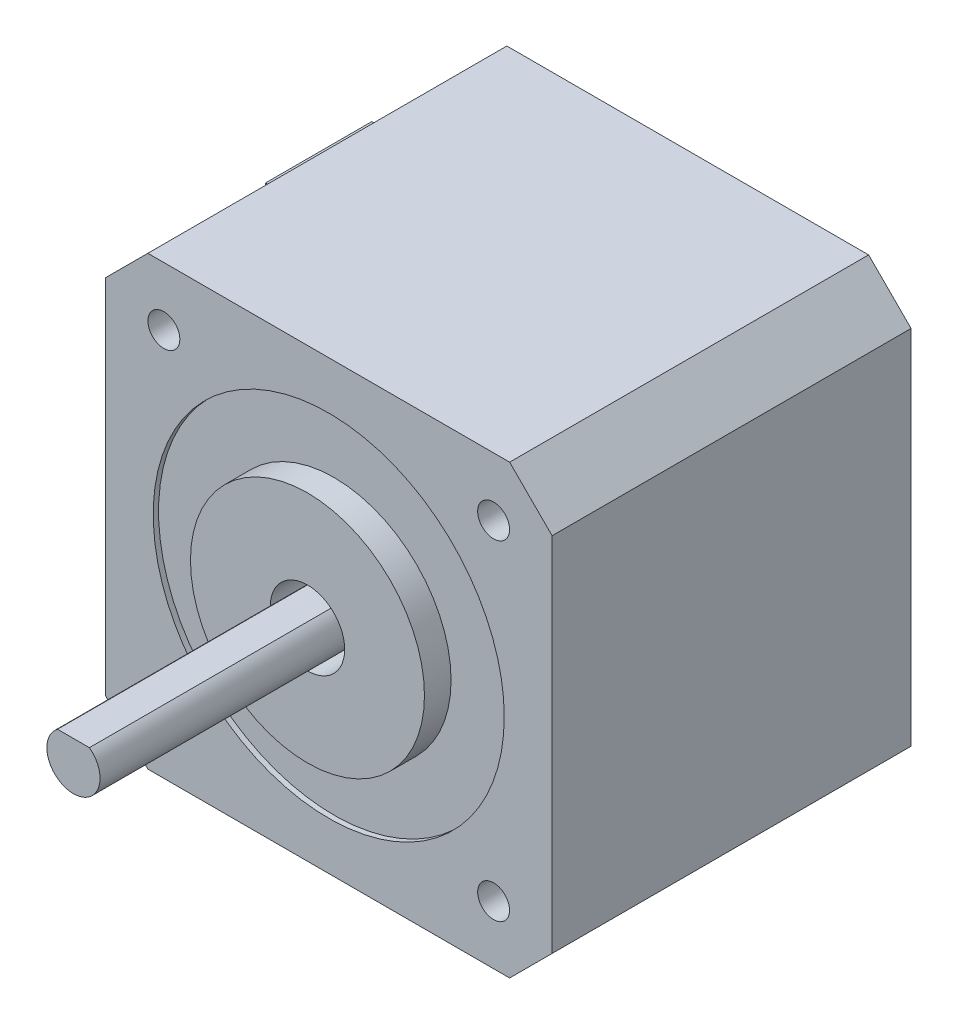
ISO-10303-21;
HEADER;
FILE_DESCRIPTION(('STEP AP214'),'2;1');
FILE_NAME('part.step','',(''),(''),'','','');
FILE_SCHEMA(('AUTOMOTIVE_DESIGN { 1 0 10303 214 1 1 1 1 }'));
ENDSEC;
DATA;
#1=APPLICATION_CONTEXT('core data for automotive mechanical design processes');
#2=APPLICATION_PROTOCOL_DEFINITION('international standard','automotive_design',2000,#1);
#3=PRODUCT_CONTEXT('',#1,'mechanical');
#4=PRODUCT('Part','Part','',(#3));
#5=PRODUCT_RELATED_PRODUCT_CATEGORY('part','',(#4));
#6=PRODUCT_DEFINITION_FORMATION('','',#4);
#7=PRODUCT_DEFINITION_CONTEXT('part definition',#1,'design');
#8=PRODUCT_DEFINITION('design','',#6,#7);
#9=PRODUCT_DEFINITION_SHAPE('','',#8);
#10=(LENGTH_UNIT() NAMED_UNIT(*) SI_UNIT(.MILLI.,.METRE.));
#11=(NAMED_UNIT(*) PLANE_ANGLE_UNIT() SI_UNIT($,.RADIAN.));
#12=(NAMED_UNIT(*) SI_UNIT($,.STERADIAN.) SOLID_ANGLE_UNIT());
#13=UNCERTAINTY_MEASURE_WITH_UNIT(LENGTH_MEASURE(1.E-05),#10,'distance_accuracy_value','');
#14=(GEOMETRIC_REPRESENTATION_CONTEXT(3) GLOBAL_UNCERTAINTY_ASSIGNED_CONTEXT((#13)) GLOBAL_UNIT_ASSIGNED_CONTEXT((#10,
#11,#12)) REPRESENTATION_CONTEXT('',''));
#15=CARTESIAN_POINT('',(0.,0.,0.));
#16=DIRECTION('',(0.,0.,1.));
#17=DIRECTION('',(1.,0.,0.));
#18=AXIS2_PLACEMENT_3D('',#15,#16,#17);
#19=CARTESIAN_POINT('',(-21.,17.0069894887769,33.75));
#20=DIRECTION('',(1.,0.,0.));
#21=DIRECTION('',(0.,0.,-1.));
#22=AXIS2_PLACEMENT_3D('',#19,#20,#21);
#23=PLANE('',#22);
#24=DIRECTION('',(0.,0.,-1.));
#25=VECTOR('',#24,1.);
#26=CARTESIAN_POINT('',(-21.,8.5,0.));
#27=LINE('',#26,#25);
#28=CARTESIAN_POINT('',(-21.,8.5,10.));
#29=VERTEX_POINT('',#28);
#30=CARTESIAN_POINT('',(-21.,8.5,0.));
#31=VERTEX_POINT('',#30);
#32=EDGE_CURVE('E50',#29,#31,#27,.T.);
#33=ORIENTED_EDGE('',*,*,#32,.F.);
#34=DIRECTION('',(0.,1.,0.));
#35=VECTOR('',#34,1.);
#36=CARTESIAN_POINT('',(-21.,8.5,10.));
#37=LINE('',#36,#35);
#38=CARTESIAN_POINT('',(-21.,-8.5,10.));
#39=VERTEX_POINT('',#38);
#40=EDGE_CURVE('E174',#39,#29,#37,.T.);
#41=ORIENTED_EDGE('',*,*,#40,.F.);
#42=DIRECTION('',(0.,0.,1.));
#43=VECTOR('',#42,1.);
#44=CARTESIAN_POINT('',(-21.,-8.5,0.));
#45=LINE('',#44,#43);
#46=CARTESIAN_POINT('',(-21.,-8.5,0.));
#47=VERTEX_POINT('',#46);
#48=EDGE_CURVE('E56',#47,#39,#45,.T.);
#49=ORIENTED_EDGE('',*,*,#48,.F.);
#50=DIRECTION('',(0.,-1.,0.));
#51=VECTOR('',#50,1.);
#52=CARTESIAN_POINT('',(-21.,17.0069894887769,0.));
#53=LINE('',#52,#51);
#54=CARTESIAN_POINT('',(-21.,-17.0069894887769,0.));
#55=VERTEX_POINT('',#54);
#56=EDGE_CURVE('E159',#47,#55,#53,.T.);
#57=ORIENTED_EDGE('',*,*,#56,.T.);
#58=DIRECTION('',(0.,0.,-1.));
#59=VECTOR('',#58,1.);
#60=CARTESIAN_POINT('',(-21.,-17.0069894887769,33.75));
#61=LINE('',#60,#59);
#62=CARTESIAN_POINT('',(-21.,-17.0069894887769,33.75));
#63=VERTEX_POINT('',#62);
#64=EDGE_CURVE('E11',#63,#55,#61,.T.);
#65=ORIENTED_EDGE('',*,*,#64,.F.);
#66=DIRECTION('',(0.,-1.,0.));
#67=VECTOR('',#66,1.);
#68=CARTESIAN_POINT('',(-21.,17.0069894887769,33.75));
#69=LINE('',#68,#67);
#70=CARTESIAN_POINT('',(-21.,17.0069894887769,33.75));
#71=VERTEX_POINT('',#70);
#72=EDGE_CURVE('E259',#71,#63,#69,.T.);
#73=ORIENTED_EDGE('',*,*,#72,.F.);
#74=DIRECTION('',(0.,0.,-1.));
#75=VECTOR('',#74,1.);
#76=CARTESIAN_POINT('',(-21.,17.0069894887769,33.75));
#77=LINE('',#76,#75);
#78=CARTESIAN_POINT('',(-21.,17.0069894887769,0.));
#79=VERTEX_POINT('',#78);
#80=EDGE_CURVE('E277',#71,#79,#77,.T.);
#81=ORIENTED_EDGE('',*,*,#80,.T.);
#82=EDGE_CURVE('E285',#79,#31,#53,.T.);
#83=ORIENTED_EDGE('',*,*,#82,.T.);
#84=EDGE_LOOP('',(#33,#41,#49,#57,#65,#73,#81,#83));
#85=FACE_BOUND('',#84,.T.);
#86=ADVANCED_FACE('F34',(#85),#23,.F.);
#87=CARTESIAN_POINT('',(0.,0.,0.));
#88=DIRECTION('',(0.,0.,1.));
#89=DIRECTION('',(1.,0.,0.));
#90=AXIS2_PLACEMENT_3D('',#87,#88,#89);
#91=PLANE('',#90);
#92=CARTESIAN_POINT('',(-15.5,15.5,0.));
#93=DIRECTION('',(0.,0.,1.));
#94=DIRECTION('',(1.,0.,0.));
#95=AXIS2_PLACEMENT_3D('',#92,#93,#94);
#96=CIRCLE('',#95,1.5);
#97=CARTESIAN_POINT('',(-14.,15.5,0.));
#98=VERTEX_POINT('',#97);
#99=EDGE_CURVE('E183',#98,#98,#96,.T.);
#100=ORIENTED_EDGE('',*,*,#99,.T.);
#101=EDGE_LOOP('',(#100));
#102=FACE_BOUND('',#101,.T.);
#103=CARTESIAN_POINT('',(-15.5,-15.5,0.));
#104=DIRECTION('',(0.,0.,1.));
#105=DIRECTION('',(1.,0.,0.));
#106=AXIS2_PLACEMENT_3D('',#103,#104,#105);
#107=CIRCLE('',#106,1.5);
#108=CARTESIAN_POINT('',(-14.,-15.5,0.));
#109=VERTEX_POINT('',#108);
#110=EDGE_CURVE('E194',#109,#109,#107,.T.);
#111=ORIENTED_EDGE('',*,*,#110,.T.);
#112=EDGE_LOOP('',(#111));
#113=FACE_BOUND('',#112,.T.);
#114=ORIENTED_EDGE('',*,*,#82,.F.);
#115=DIRECTION('',(-0.707106781186548,-0.707106781186548,0.));
#116=VECTOR('',#115,1.);
#117=CARTESIAN_POINT('',(-17.0069894887769,21.,0.));
#118=LINE('',#117,#116);
#119=CARTESIAN_POINT('',(-17.0069894887769,21.,0.));
#120=VERTEX_POINT('',#119);
#121=EDGE_CURVE('E263',#120,#79,#118,.T.);
#122=ORIENTED_EDGE('',*,*,#121,.F.);
#123=DIRECTION('',(-1.,0.,0.));
#124=VECTOR('',#123,1.);
#125=CARTESIAN_POINT('',(-17.0069894887769,21.,0.));
#126=LINE('',#125,#124);
#127=CARTESIAN_POINT('',(17.0069894887769,21.,0.));
#128=VERTEX_POINT('',#127);
#129=EDGE_CURVE('E307',#128,#120,#126,.T.);
#130=ORIENTED_EDGE('',*,*,#129,.F.);
#131=DIRECTION('',(-0.707106781186549,0.707106781186546,0.));
#132=VECTOR('',#131,1.);
#133=CARTESIAN_POINT('',(17.0069894887769,21.,0.));
#134=LINE('',#133,#132);
#135=CARTESIAN_POINT('',(21.,17.0069894887769,0.));
#136=VERTEX_POINT('',#135);
#137=EDGE_CURVE('E309',#136,#128,#134,.T.);
#138=ORIENTED_EDGE('',*,*,#137,.F.);
#139=DIRECTION('',(0.,1.,0.));
#140=VECTOR('',#139,1.);
#141=CARTESIAN_POINT('',(21.,17.0069894887769,0.));
#142=LINE('',#141,#140);
#143=CARTESIAN_POINT('',(21.,-17.0069894887769,0.));
#144=VERTEX_POINT('',#143);
#145=EDGE_CURVE('E311',#144,#136,#142,.T.);
#146=ORIENTED_EDGE('',*,*,#145,.F.);
#147=DIRECTION('',(0.707106781186548,0.707106781186547,0.));
#148=VECTOR('',#147,1.);
#149=CARTESIAN_POINT('',(21.,-17.0069894887769,0.));
#150=LINE('',#149,#148);
#151=CARTESIAN_POINT('',(17.0069894887769,-21.,0.));
#152=VERTEX_POINT('',#151);
#153=EDGE_CURVE('E313',#152,#144,#150,.T.);
#154=ORIENTED_EDGE('',*,*,#153,.F.);
#155=DIRECTION('',(1.,0.,0.));
#156=VECTOR('',#155,1.);
#157=CARTESIAN_POINT('',(-17.0069894887769,-21.,0.));
#158=LINE('',#157,#156);
#159=CARTESIAN_POINT('',(-17.0069894887769,-21.,0.));
#160=VERTEX_POINT('',#159);
#161=EDGE_CURVE('E314',#160,#152,#158,.T.);
#162=ORIENTED_EDGE('',*,*,#161,.F.);
#163=DIRECTION('',(0.707106781186548,-0.707106781186547,0.));
#164=VECTOR('',#163,1.);
#165=CARTESIAN_POINT('',(-21.,-17.0069894887769,0.));
#166=LINE('',#165,#164);
#167=EDGE_CURVE('E280',#55,#160,#166,.T.);
#168=ORIENTED_EDGE('',*,*,#167,.F.);
#169=ORIENTED_EDGE('',*,*,#56,.F.);
#170=DIRECTION('',(1.,0.,0.));
#171=VECTOR('',#170,1.);
#172=CARTESIAN_POINT('',(-29.7,-8.5,0.));
#173=LINE('',#172,#171);
#174=CARTESIAN_POINT('',(-29.7,-8.5,0.));
#175=VERTEX_POINT('',#174);
#176=EDGE_CURVE('E139',#175,#47,#173,.T.);
#177=ORIENTED_EDGE('',*,*,#176,.F.);
#178=DIRECTION('',(0.,-1.,0.));
#179=VECTOR('',#178,1.);
#180=CARTESIAN_POINT('',(-29.7,8.49999999999999,0.));
#181=LINE('',#180,#179);
#182=CARTESIAN_POINT('',(-29.7,8.49999999999999,0.));
#183=VERTEX_POINT('',#182);
#184=EDGE_CURVE('E145',#183,#175,#181,.T.);
#185=ORIENTED_EDGE('',*,*,#184,.F.);
#186=DIRECTION('',(1.,0.,0.));
#187=VECTOR('',#186,1.);
#188=CARTESIAN_POINT('',(-29.7,8.49999999999999,0.));
#189=LINE('',#188,#187);
#190=EDGE_CURVE('E175',#183,#31,#189,.T.);
#191=ORIENTED_EDGE('',*,*,#190,.T.);
#192=EDGE_LOOP('',(#114,#122,#130,#138,#146,#154,#162,#168,#169,#177,#185,#191));
#193=FACE_BOUND('',#192,.T.);
#194=CARTESIAN_POINT('',(15.5,-15.5,0.));
#195=DIRECTION('',(0.,0.,1.));
#196=DIRECTION('',(1.,0.,0.));
#197=AXIS2_PLACEMENT_3D('',#194,#195,#196);
#198=CIRCLE('',#197,1.5);
#199=CARTESIAN_POINT('',(17.,-15.5,0.));
#200=VERTEX_POINT('',#199);
#201=EDGE_CURVE('E188',#200,#200,#198,.T.);
#202=ORIENTED_EDGE('',*,*,#201,.T.);
#203=EDGE_LOOP('',(#202));
#204=FACE_BOUND('',#203,.T.);
#205=CARTESIAN_POINT('',(15.5,15.5,0.));
#206=DIRECTION('',(0.,0.,1.));
#207=DIRECTION('',(1.,0.,0.));
#208=AXIS2_PLACEMENT_3D('',#205,#206,#207);
#209=CIRCLE('',#208,1.5);
#210=CARTESIAN_POINT('',(17.,15.5,0.));
#211=VERTEX_POINT('',#210);
#212=EDGE_CURVE('E160',#211,#211,#209,.T.);
#213=ORIENTED_EDGE('',*,*,#212,.T.);
#214=EDGE_LOOP('',(#213));
#215=FACE_BOUND('',#214,.T.);
#216=ADVANCED_FACE('F156',(#102,#113,#193,#204,#215),#91,.F.);
#217=CARTESIAN_POINT('',(0.,0.,30.75));
#218=DIRECTION('',(0.,0.,1.));
#219=DIRECTION('',(1.,0.,0.));
#220=AXIS2_PLACEMENT_3D('',#217,#218,#219);
#221=PLANE('',#220);
#222=CARTESIAN_POINT('',(0.,0.,30.75));
#223=DIRECTION('',(0.,0.,1.));
#224=DIRECTION('',(1.,0.,0.));
#225=AXIS2_PLACEMENT_3D('',#222,#223,#224);
#226=CIRCLE('',#225,3.5);
#227=CARTESIAN_POINT('',(3.5,0.,30.75));
#228=VERTEX_POINT('',#227);
#229=EDGE_CURVE('E242',#228,#228,#226,.T.);
#230=ORIENTED_EDGE('',*,*,#229,.T.);
#231=EDGE_LOOP('',(#230));
#232=FACE_BOUND('',#231,.T.);
#233=DIRECTION('',(-1.,0.,0.));
#234=VECTOR('',#233,1.);
#235=CARTESIAN_POINT('',(-1.5,2.,30.75));
#236=LINE('',#235,#234);
#237=CARTESIAN_POINT('',(1.49999999999999,2.,30.75));
#238=VERTEX_POINT('',#237);
#239=CARTESIAN_POINT('',(-1.5,2.,30.75));
#240=VERTEX_POINT('',#239);
#241=EDGE_CURVE('E231',#238,#240,#236,.T.);
#242=ORIENTED_EDGE('',*,*,#241,.F.);
#243=CARTESIAN_POINT('',(0.,0.,30.75));
#244=DIRECTION('',(0.,0.,1.));
#245=DIRECTION('',(1.,0.,0.));
#246=AXIS2_PLACEMENT_3D('',#243,#244,#245);
#247=CIRCLE('',#246,2.5);
#248=EDGE_CURVE('E224',#240,#238,#247,.T.);
#249=ORIENTED_EDGE('',*,*,#248,.F.);
#250=EDGE_LOOP('',(#242,#249));
#251=FACE_BOUND('',#250,.T.);
#252=ADVANCED_FACE('F346',(#232,#251),#221,.T.);
#253=CARTESIAN_POINT('',(0.,0.,33.25));
#254=DIRECTION('',(0.,0.,1.));
#255=DIRECTION('',(1.,0.,0.));
#256=AXIS2_PLACEMENT_3D('',#253,#254,#255);
#257=PLANE('',#256);
#258=CARTESIAN_POINT('',(0.,0.,33.25));
#259=DIRECTION('',(0.,0.,1.));
#260=DIRECTION('',(1.,0.,0.));
#261=AXIS2_PLACEMENT_3D('',#258,#259,#260);
#262=CIRCLE('',#261,16.5);
#263=CARTESIAN_POINT('',(16.5,0.,33.25));
#264=VERTEX_POINT('',#263);
#265=EDGE_CURVE('E254',#264,#264,#262,.T.);
#266=ORIENTED_EDGE('',*,*,#265,.T.);
#267=EDGE_LOOP('',(#266));
#268=FACE_BOUND('',#267,.T.);
#269=CARTESIAN_POINT('',(0.,0.,33.25));
#270=DIRECTION('',(0.,0.,1.));
#271=DIRECTION('',(1.,0.,0.));
#272=AXIS2_PLACEMENT_3D('',#269,#270,#271);
#273=CIRCLE('',#272,11.);
#274=CARTESIAN_POINT('',(11.,0.,33.25));
#275=VERTEX_POINT('',#274);
#276=EDGE_CURVE('E245',#275,#275,#273,.T.);
#277=ORIENTED_EDGE('',*,*,#276,.F.);
#278=EDGE_LOOP('',(#277));
#279=FACE_BOUND('',#278,.T.);
#280=ADVANCED_FACE('F352',(#268,#279),#257,.T.);
#281=CARTESIAN_POINT('',(-21.,-17.0069894887769,33.75));
#282=DIRECTION('',(0.707106781186547,0.707106781186548,0.));
#283=DIRECTION('',(-0.707106781186548,0.707106781186547,0.));
#284=AXIS2_PLACEMENT_3D('',#281,#282,#283);
#285=PLANE('',#284);
#286=ORIENTED_EDGE('',*,*,#167,.T.);
#287=DIRECTION('',(0.,0.,-1.));
#288=VECTOR('',#287,1.);
#289=CARTESIAN_POINT('',(-17.0069894887769,-21.,33.75));
#290=LINE('',#289,#288);
#291=CARTESIAN_POINT('',(-17.0069894887769,-21.,33.75));
#292=VERTEX_POINT('',#291);
#293=EDGE_CURVE('E42',#292,#160,#290,.T.);
#294=ORIENTED_EDGE('',*,*,#293,.F.);
#295=DIRECTION('',(0.707106781186548,-0.707106781186547,0.));
#296=VECTOR('',#295,1.);
#297=CARTESIAN_POINT('',(-21.,-17.0069894887769,33.75));
#298=LINE('',#297,#296);
#299=EDGE_CURVE('E262',#63,#292,#298,.T.);
#300=ORIENTED_EDGE('',*,*,#299,.F.);
#301=ORIENTED_EDGE('',*,*,#64,.T.);
#302=EDGE_LOOP('',(#286,#294,#300,#301));
#303=FACE_BOUND('',#302,.T.);
#304=ADVANCED_FACE('F320',(#303),#285,.F.);
#305=CARTESIAN_POINT('',(-17.0069894887769,-21.,33.75));
#306=DIRECTION('',(0.,1.,0.));
#307=DIRECTION('',(-1.,0.,0.));
#308=AXIS2_PLACEMENT_3D('',#305,#306,#307);
#309=PLANE('',#308);
#310=ORIENTED_EDGE('',*,*,#161,.T.);
#311=DIRECTION('',(0.,0.,-1.));
#312=VECTOR('',#311,1.);
#313=CARTESIAN_POINT('',(17.0069894887769,-21.,33.75));
#314=LINE('',#313,#312);
#315=CARTESIAN_POINT('',(17.0069894887769,-21.,33.75));
#316=VERTEX_POINT('',#315);
#317=EDGE_CURVE('E289',#316,#152,#314,.T.);
#318=ORIENTED_EDGE('',*,*,#317,.F.);
#319=DIRECTION('',(1.,0.,0.));
#320=VECTOR('',#319,1.);
#321=CARTESIAN_POINT('',(-17.0069894887769,-21.,33.75));
#322=LINE('',#321,#320);
#323=EDGE_CURVE('E265',#292,#316,#322,.T.);
#324=ORIENTED_EDGE('',*,*,#323,.F.);
#325=ORIENTED_EDGE('',*,*,#293,.T.);
#326=EDGE_LOOP('',(#310,#318,#324,#325));
#327=FACE_BOUND('',#326,.T.);
#328=ADVANCED_FACE('F323',(#327),#309,.F.);
#329=CARTESIAN_POINT('',(21.,-17.0069894887769,33.75));
#330=DIRECTION('',(-0.707106781186547,0.707106781186548,0.));
#331=DIRECTION('',(-0.707106781186548,-0.707106781186547,0.));
#332=AXIS2_PLACEMENT_3D('',#329,#330,#331);
#333=PLANE('',#332);
#334=ORIENTED_EDGE('',*,*,#153,.T.);
#335=DIRECTION('',(0.,0.,-1.));
#336=VECTOR('',#335,1.);
#337=CARTESIAN_POINT('',(21.,-17.0069894887769,33.75));
#338=LINE('',#337,#336);
#339=CARTESIAN_POINT('',(21.,-17.0069894887769,33.75));
#340=VERTEX_POINT('',#339);
#341=EDGE_CURVE('E292',#340,#144,#338,.T.);
#342=ORIENTED_EDGE('',*,*,#341,.F.);
#343=DIRECTION('',(0.707106781186548,0.707106781186547,0.));
#344=VECTOR('',#343,1.);
#345=CARTESIAN_POINT('',(21.,-17.0069894887769,33.75));
#346=LINE('',#345,#344);
#347=EDGE_CURVE('E267',#316,#340,#346,.T.);
#348=ORIENTED_EDGE('',*,*,#347,.F.);
#349=ORIENTED_EDGE('',*,*,#317,.T.);
#350=EDGE_LOOP('',(#334,#342,#348,#349));
#351=FACE_BOUND('',#350,.T.);
#352=ADVANCED_FACE('F329',(#351),#333,.F.);
#353=CARTESIAN_POINT('',(21.,17.0069894887769,33.75));
#354=DIRECTION('',(-1.,0.,0.));
#355=DIRECTION('',(0.,0.,1.));
#356=AXIS2_PLACEMENT_3D('',#353,#354,#355);
#357=PLANE('',#356);
#358=ORIENTED_EDGE('',*,*,#145,.T.);
#359=DIRECTION('',(0.,0.,-1.));
#360=VECTOR('',#359,1.);
#361=CARTESIAN_POINT('',(21.,17.0069894887769,33.75));
#362=LINE('',#361,#360);
#363=CARTESIAN_POINT('',(21.,17.0069894887769,33.75));
#364=VERTEX_POINT('',#363);
#365=EDGE_CURVE('E295',#364,#136,#362,.T.);
#366=ORIENTED_EDGE('',*,*,#365,.F.);
#367=DIRECTION('',(0.,1.,0.));
#368=VECTOR('',#367,1.);
#369=CARTESIAN_POINT('',(21.,17.0069894887769,33.75));
#370=LINE('',#369,#368);
#371=EDGE_CURVE('E269',#340,#364,#370,.T.);
#372=ORIENTED_EDGE('',*,*,#371,.F.);
#373=ORIENTED_EDGE('',*,*,#341,.T.);
#374=EDGE_LOOP('',(#358,#366,#372,#373));
#375=FACE_BOUND('',#374,.T.);
#376=ADVANCED_FACE('F333',(#375),#357,.F.);
#377=CARTESIAN_POINT('',(17.0069894887769,21.,33.75));
#378=DIRECTION('',(-0.707106781186546,-0.707106781186549,0.));
#379=DIRECTION('',(0.707106781186549,-0.707106781186546,0.));
#380=AXIS2_PLACEMENT_3D('',#377,#378,#379);
#381=PLANE('',#380);
#382=ORIENTED_EDGE('',*,*,#137,.T.);
#383=DIRECTION('',(0.,0.,-1.));
#384=VECTOR('',#383,1.);
#385=CARTESIAN_POINT('',(17.0069894887769,21.,33.75));
#386=LINE('',#385,#384);
#387=CARTESIAN_POINT('',(17.0069894887769,21.,33.75));
#388=VERTEX_POINT('',#387);
#389=EDGE_CURVE('E298',#388,#128,#386,.T.);
#390=ORIENTED_EDGE('',*,*,#389,.F.);
#391=DIRECTION('',(-0.707106781186549,0.707106781186546,0.));
#392=VECTOR('',#391,1.);
#393=CARTESIAN_POINT('',(17.0069894887769,21.,33.75));
#394=LINE('',#393,#392);
#395=EDGE_CURVE('E271',#364,#388,#394,.T.);
#396=ORIENTED_EDGE('',*,*,#395,.F.);
#397=ORIENTED_EDGE('',*,*,#365,.T.);
#398=EDGE_LOOP('',(#382,#390,#396,#397));
#399=FACE_BOUND('',#398,.T.);
#400=ADVANCED_FACE('F366',(#399),#381,.F.);
#401=CARTESIAN_POINT('',(-17.0069894887769,21.,33.75));
#402=DIRECTION('',(0.,-1.,0.));
#403=DIRECTION('',(1.,0.,0.));
#404=AXIS2_PLACEMENT_3D('',#401,#402,#403);
#405=PLANE('',#404);
#406=ORIENTED_EDGE('',*,*,#129,.T.);
#407=DIRECTION('',(0.,0.,-1.));
#408=VECTOR('',#407,1.);
#409=CARTESIAN_POINT('',(-17.0069894887769,21.,33.75));
#410=LINE('',#409,#408);
#411=CARTESIAN_POINT('',(-17.0069894887769,21.,33.75));
#412=VERTEX_POINT('',#411);
#413=EDGE_CURVE('E301',#412,#120,#410,.T.);
#414=ORIENTED_EDGE('',*,*,#413,.F.);
#415=DIRECTION('',(-1.,0.,0.));
#416=VECTOR('',#415,1.);
#417=CARTESIAN_POINT('',(-17.0069894887769,21.,33.75));
#418=LINE('',#417,#416);
#419=EDGE_CURVE('E273',#388,#412,#418,.T.);
#420=ORIENTED_EDGE('',*,*,#419,.F.);
#421=ORIENTED_EDGE('',*,*,#389,.T.);
#422=EDGE_LOOP('',(#406,#414,#420,#421));
#423=FACE_BOUND('',#422,.T.);
#424=ADVANCED_FACE('F362',(#423),#405,.F.);
#425=CARTESIAN_POINT('',(-17.0069894887769,21.,33.75));
#426=DIRECTION('',(0.707106781186547,-0.707106781186547,0.));
#427=DIRECTION('',(0.707106781186548,0.707106781186548,0.));
#428=AXIS2_PLACEMENT_3D('',#425,#426,#427);
#429=PLANE('',#428);
#430=ORIENTED_EDGE('',*,*,#121,.T.);
#431=ORIENTED_EDGE('',*,*,#80,.F.);
#432=DIRECTION('',(-0.707106781186548,-0.707106781186548,0.));
#433=VECTOR('',#432,1.);
#434=CARTESIAN_POINT('',(-17.0069894887769,21.,33.75));
#435=LINE('',#434,#433);
#436=EDGE_CURVE('E275',#412,#71,#435,.T.);
#437=ORIENTED_EDGE('',*,*,#436,.F.);
#438=ORIENTED_EDGE('',*,*,#413,.T.);
#439=EDGE_LOOP('',(#430,#431,#437,#438));
#440=FACE_BOUND('',#439,.T.);
#441=ADVANCED_FACE('F359',(#440),#429,.F.);
#442=CARTESIAN_POINT('',(0.,0.,33.75));
#443=DIRECTION('',(0.,0.,1.));
#444=DIRECTION('',(1.,0.,0.));
#445=AXIS2_PLACEMENT_3D('',#442,#443,#444);
#446=PLANE('',#445);
#447=CARTESIAN_POINT('',(15.5,15.5,33.75));
#448=DIRECTION('',(0.,0.,1.));
#449=DIRECTION('',(1.,0.,0.));
#450=AXIS2_PLACEMENT_3D('',#447,#448,#449);
#451=CIRCLE('',#450,1.5);
#452=CARTESIAN_POINT('',(17.,15.5,33.75));
#453=VERTEX_POINT('',#452);
#454=EDGE_CURVE('E203',#453,#453,#451,.T.);
#455=ORIENTED_EDGE('',*,*,#454,.F.);
#456=EDGE_LOOP('',(#455));
#457=FACE_BOUND('',#456,.T.);
#458=CARTESIAN_POINT('',(-15.5,15.5,33.75));
#459=DIRECTION('',(0.,0.,1.));
#460=DIRECTION('',(1.,0.,0.));
#461=AXIS2_PLACEMENT_3D('',#458,#459,#460);
#462=CIRCLE('',#461,1.5);
#463=CARTESIAN_POINT('',(-14.,15.5,33.75));
#464=VERTEX_POINT('',#463);
#465=EDGE_CURVE('E209',#464,#464,#462,.T.);
#466=ORIENTED_EDGE('',*,*,#465,.F.);
#467=EDGE_LOOP('',(#466));
#468=FACE_BOUND('',#467,.T.);
#469=CARTESIAN_POINT('',(15.5,-15.5,33.75));
#470=DIRECTION('',(0.,0.,1.));
#471=DIRECTION('',(1.,0.,0.));
#472=AXIS2_PLACEMENT_3D('',#469,#470,#471);
#473=CIRCLE('',#472,1.5);
#474=CARTESIAN_POINT('',(17.,-15.5,33.75));
#475=VERTEX_POINT('',#474);
#476=EDGE_CURVE('E215',#475,#475,#473,.T.);
#477=ORIENTED_EDGE('',*,*,#476,.F.);
#478=EDGE_LOOP('',(#477));
#479=FACE_BOUND('',#478,.T.);
#480=CARTESIAN_POINT('',(-15.5,-15.5,33.75));
#481=DIRECTION('',(0.,0.,1.));
#482=DIRECTION('',(1.,0.,0.));
#483=AXIS2_PLACEMENT_3D('',#480,#481,#482);
#484=CIRCLE('',#483,1.5);
#485=CARTESIAN_POINT('',(-14.,-15.5,33.75));
#486=VERTEX_POINT('',#485);
#487=EDGE_CURVE('E218',#486,#486,#484,.T.);
#488=ORIENTED_EDGE('',*,*,#487,.F.);
#489=EDGE_LOOP('',(#488));
#490=FACE_BOUND('',#489,.T.);
#491=CARTESIAN_POINT('',(0.,0.,33.75));
#492=DIRECTION('',(0.,0.,1.));
#493=DIRECTION('',(1.,0.,0.));
#494=AXIS2_PLACEMENT_3D('',#491,#492,#493);
#495=CIRCLE('',#494,16.5);
#496=CARTESIAN_POINT('',(16.5,0.,33.75));
#497=VERTEX_POINT('',#496);
#498=EDGE_CURVE('E251',#497,#497,#495,.T.);
#499=ORIENTED_EDGE('',*,*,#498,.F.);
#500=EDGE_LOOP('',(#499));
#501=FACE_BOUND('',#500,.T.);
#502=ORIENTED_EDGE('',*,*,#72,.T.);
#503=ORIENTED_EDGE('',*,*,#299,.T.);
#504=ORIENTED_EDGE('',*,*,#323,.T.);
#505=ORIENTED_EDGE('',*,*,#347,.T.);
#506=ORIENTED_EDGE('',*,*,#371,.T.);
#507=ORIENTED_EDGE('',*,*,#395,.T.);
#508=ORIENTED_EDGE('',*,*,#419,.T.);
#509=ORIENTED_EDGE('',*,*,#436,.T.);
#510=EDGE_LOOP('',(#502,#503,#504,#505,#506,#507,#508,#509));
#511=FACE_BOUND('',#510,.T.);
#512=ADVANCED_FACE('F337',(#457,#468,#479,#490,#501,#511),#446,.T.);
#513=CARTESIAN_POINT('',(0.,0.,33.25));
#514=DIRECTION('',(0.,0.,1.));
#515=DIRECTION('',(1.,0.,0.));
#516=AXIS2_PLACEMENT_3D('',#513,#514,#515);
#517=CYLINDRICAL_SURFACE('',#516,16.5);
#518=ORIENTED_EDGE('',*,*,#265,.F.);
#519=EDGE_LOOP('',(#518));
#520=FACE_BOUND('',#519,.T.);
#521=ORIENTED_EDGE('',*,*,#498,.T.);
#522=EDGE_LOOP('',(#521));
#523=FACE_BOUND('',#522,.T.);
#524=ADVANCED_FACE('F388',(#520,#523),#517,.F.);
#525=CARTESIAN_POINT('',(0.,0.,35.75));
#526=DIRECTION('',(0.,0.,-1.));
#527=DIRECTION('',(-1.,0.,0.));
#528=AXIS2_PLACEMENT_3D('',#525,#526,#527);
#529=CYLINDRICAL_SURFACE('',#528,11.);
#530=CARTESIAN_POINT('',(0.,0.,35.75));
#531=DIRECTION('',(0.,0.,1.));
#532=DIRECTION('',(1.,0.,0.));
#533=AXIS2_PLACEMENT_3D('',#530,#531,#532);
#534=CIRCLE('',#533,11.);
#535=CARTESIAN_POINT('',(11.,0.,35.75));
#536=VERTEX_POINT('',#535);
#537=EDGE_CURVE('E248',#536,#536,#534,.T.);
#538=ORIENTED_EDGE('',*,*,#537,.F.);
#539=EDGE_LOOP('',(#538));
#540=FACE_BOUND('',#539,.T.);
#541=ORIENTED_EDGE('',*,*,#276,.T.);
#542=EDGE_LOOP('',(#541));
#543=FACE_BOUND('',#542,.T.);
#544=ADVANCED_FACE('F386',(#540,#543),#529,.T.);
#545=CARTESIAN_POINT('',(0.,0.,35.75));
#546=DIRECTION('',(0.,0.,1.));
#547=DIRECTION('',(1.,0.,0.));
#548=AXIS2_PLACEMENT_3D('',#545,#546,#547);
#549=PLANE('',#548);
#550=CARTESIAN_POINT('',(0.,0.,35.75));
#551=DIRECTION('',(0.,0.,1.));
#552=DIRECTION('',(1.,0.,0.));
#553=AXIS2_PLACEMENT_3D('',#550,#551,#552);
#554=CIRCLE('',#553,3.5);
#555=CARTESIAN_POINT('',(3.5,0.,35.75));
#556=VERTEX_POINT('',#555);
#557=EDGE_CURVE('E241',#556,#556,#554,.T.);
#558=ORIENTED_EDGE('',*,*,#557,.F.);
#559=EDGE_LOOP('',(#558));
#560=FACE_BOUND('',#559,.T.);
#561=ORIENTED_EDGE('',*,*,#537,.T.);
#562=EDGE_LOOP('',(#561));
#563=FACE_BOUND('',#562,.T.);
#564=ADVANCED_FACE('F395',(#560,#563),#549,.T.);
#565=CARTESIAN_POINT('',(0.,0.,30.75));
#566=DIRECTION('',(0.,0.,1.));
#567=DIRECTION('',(1.,0.,0.));
#568=AXIS2_PLACEMENT_3D('',#565,#566,#567);
#569=CYLINDRICAL_SURFACE('',#568,3.5);
#570=ORIENTED_EDGE('',*,*,#229,.F.);
#571=EDGE_LOOP('',(#570));
#572=FACE_BOUND('',#571,.T.);
#573=ORIENTED_EDGE('',*,*,#557,.T.);
#574=EDGE_LOOP('',(#573));
#575=FACE_BOUND('',#574,.T.);
#576=ADVANCED_FACE('F436',(#572,#575),#569,.F.);
#577=CARTESIAN_POINT('',(0.,0.,57.75));
#578=DIRECTION('',(0.,0.,-1.));
#579=DIRECTION('',(-1.,0.,0.));
#580=AXIS2_PLACEMENT_3D('',#577,#578,#579);
#581=CYLINDRICAL_SURFACE('',#580,2.5);
#582=ORIENTED_EDGE('',*,*,#248,.T.);
#583=DIRECTION('',(0.,0.,-1.));
#584=VECTOR('',#583,1.);
#585=CARTESIAN_POINT('',(1.49999999999999,2.,57.75));
#586=LINE('',#585,#584);
#587=CARTESIAN_POINT('',(1.49999999999999,2.,57.75));
#588=VERTEX_POINT('',#587);
#589=EDGE_CURVE('E238',#588,#238,#586,.T.);
#590=ORIENTED_EDGE('',*,*,#589,.F.);
#591=CARTESIAN_POINT('',(0.,0.,57.75));
#592=DIRECTION('',(0.,0.,1.));
#593=DIRECTION('',(1.,0.,0.));
#594=AXIS2_PLACEMENT_3D('',#591,#592,#593);
#595=CIRCLE('',#594,2.5);
#596=CARTESIAN_POINT('',(-1.5,2.,57.75));
#597=VERTEX_POINT('',#596);
#598=EDGE_CURVE('E227',#597,#588,#595,.T.);
#599=ORIENTED_EDGE('',*,*,#598,.F.);
#600=DIRECTION('',(0.,0.,-1.));
#601=VECTOR('',#600,1.);
#602=CARTESIAN_POINT('',(-1.5,2.,57.75));
#603=LINE('',#602,#601);
#604=EDGE_CURVE('E233',#597,#240,#603,.T.);
#605=ORIENTED_EDGE('',*,*,#604,.T.);
#606=EDGE_LOOP('',(#582,#590,#599,#605));
#607=FACE_BOUND('',#606,.T.);
#608=ADVANCED_FACE('F433',(#607),#581,.T.);
#609=CARTESIAN_POINT('',(-1.5,2.,57.75));
#610=DIRECTION('',(0.,-1.,0.));
#611=DIRECTION('',(0.,0.,-1.));
#612=AXIS2_PLACEMENT_3D('',#609,#610,#611);
#613=PLANE('',#612);
#614=ORIENTED_EDGE('',*,*,#241,.T.);
#615=ORIENTED_EDGE('',*,*,#604,.F.);
#616=DIRECTION('',(-1.,0.,0.));
#617=VECTOR('',#616,1.);
#618=CARTESIAN_POINT('',(-1.5,2.,57.75));
#619=LINE('',#618,#617);
#620=EDGE_CURVE('E230',#588,#597,#619,.T.);
#621=ORIENTED_EDGE('',*,*,#620,.F.);
#622=ORIENTED_EDGE('',*,*,#589,.T.);
#623=EDGE_LOOP('',(#614,#615,#621,#622));
#624=FACE_BOUND('',#623,.T.);
#625=ADVANCED_FACE('F425',(#624),#613,.F.);
#626=CARTESIAN_POINT('',(0.,0.,57.75));
#627=DIRECTION('',(0.,0.,1.));
#628=DIRECTION('',(1.,0.,0.));
#629=AXIS2_PLACEMENT_3D('',#626,#627,#628);
#630=PLANE('',#629);
#631=ORIENTED_EDGE('',*,*,#598,.T.);
#632=ORIENTED_EDGE('',*,*,#620,.T.);
#633=EDGE_LOOP('',(#631,#632));
#634=FACE_BOUND('',#633,.T.);
#635=ADVANCED_FACE('F415',(#634),#630,.T.);
#636=CARTESIAN_POINT('',(-15.5,-15.5,28.75));
#637=DIRECTION('',(0.,0.,1.));
#638=DIRECTION('',(1.,0.,0.));
#639=AXIS2_PLACEMENT_3D('',#636,#637,#638);
#640=CYLINDRICAL_SURFACE('',#639,1.5);
#641=CARTESIAN_POINT('',(-15.5,-15.5,28.75));
#642=DIRECTION('',(0.,0.,1.));
#643=DIRECTION('',(1.,0.,0.));
#644=AXIS2_PLACEMENT_3D('',#641,#642,#643);
#645=CIRCLE('',#644,1.5);
#646=CARTESIAN_POINT('',(-14.,-15.5,28.75));
#647=VERTEX_POINT('',#646);
#648=EDGE_CURVE('E221',#647,#647,#645,.T.);
#649=ORIENTED_EDGE('',*,*,#648,.F.);
#650=EDGE_LOOP('',(#649));
#651=FACE_BOUND('',#650,.T.);
#652=ORIENTED_EDGE('',*,*,#487,.T.);
#653=EDGE_LOOP('',(#652));
#654=FACE_BOUND('',#653,.T.);
#655=ADVANCED_FACE('F412',(#651,#654),#640,.F.);
#656=CARTESIAN_POINT('',(-15.5,-15.5,28.75));
#657=DIRECTION('',(0.,0.,1.));
#658=DIRECTION('',(1.,0.,0.));
#659=AXIS2_PLACEMENT_3D('',#656,#657,#658);
#660=PLANE('',#659);
#661=ORIENTED_EDGE('',*,*,#648,.T.);
#662=EDGE_LOOP('',(#661));
#663=FACE_BOUND('',#662,.T.);
#664=ADVANCED_FACE('F414',(#663),#660,.T.);
#665=CARTESIAN_POINT('',(15.5,-15.5,28.75));
#666=DIRECTION('',(0.,0.,1.));
#667=DIRECTION('',(1.,0.,0.));
#668=AXIS2_PLACEMENT_3D('',#665,#666,#667);
#669=CYLINDRICAL_SURFACE('',#668,1.5);
#670=CARTESIAN_POINT('',(15.5,-15.5,28.75));
#671=DIRECTION('',(0.,0.,1.));
#672=DIRECTION('',(1.,0.,0.));
#673=AXIS2_PLACEMENT_3D('',#670,#671,#672);
#674=CIRCLE('',#673,1.5);
#675=CARTESIAN_POINT('',(17.,-15.5,28.75));
#676=VERTEX_POINT('',#675);
#677=EDGE_CURVE('E212',#676,#676,#674,.T.);
#678=ORIENTED_EDGE('',*,*,#677,.F.);
#679=EDGE_LOOP('',(#678));
#680=FACE_BOUND('',#679,.T.);
#681=ORIENTED_EDGE('',*,*,#476,.T.);
#682=EDGE_LOOP('',(#681));
#683=FACE_BOUND('',#682,.T.);
#684=ADVANCED_FACE('F422',(#680,#683),#669,.F.);
#685=CARTESIAN_POINT('',(15.5,-15.5,28.75));
#686=DIRECTION('',(0.,0.,1.));
#687=DIRECTION('',(1.,0.,0.));
#688=AXIS2_PLACEMENT_3D('',#685,#686,#687);
#689=PLANE('',#688);
#690=ORIENTED_EDGE('',*,*,#677,.T.);
#691=EDGE_LOOP('',(#690));
#692=FACE_BOUND('',#691,.T.);
#693=ADVANCED_FACE('F495',(#692),#689,.T.);
#694=CARTESIAN_POINT('',(-15.5,15.5,28.75));
#695=DIRECTION('',(0.,0.,1.));
#696=DIRECTION('',(1.,0.,0.));
#697=AXIS2_PLACEMENT_3D('',#694,#695,#696);
#698=CYLINDRICAL_SURFACE('',#697,1.5);
#699=CARTESIAN_POINT('',(-15.5,15.5,28.75));
#700=DIRECTION('',(0.,0.,1.));
#701=DIRECTION('',(1.,0.,0.));
#702=AXIS2_PLACEMENT_3D('',#699,#700,#701);
#703=CIRCLE('',#702,1.5);
#704=CARTESIAN_POINT('',(-14.,15.5,28.75));
#705=VERTEX_POINT('',#704);
#706=EDGE_CURVE('E206',#705,#705,#703,.T.);
#707=ORIENTED_EDGE('',*,*,#706,.F.);
#708=EDGE_LOOP('',(#707));
#709=FACE_BOUND('',#708,.T.);
#710=ORIENTED_EDGE('',*,*,#465,.T.);
#711=EDGE_LOOP('',(#710));
#712=FACE_BOUND('',#711,.T.);
#713=ADVANCED_FACE('F505',(#709,#712),#698,.F.);
#714=CARTESIAN_POINT('',(-15.5,15.5,28.75));
#715=DIRECTION('',(0.,0.,1.));
#716=DIRECTION('',(1.,0.,0.));
#717=AXIS2_PLACEMENT_3D('',#714,#715,#716);
#718=PLANE('',#717);
#719=ORIENTED_EDGE('',*,*,#706,.T.);
#720=EDGE_LOOP('',(#719));
#721=FACE_BOUND('',#720,.T.);
#722=ADVANCED_FACE('F514',(#721),#718,.T.);
#723=CARTESIAN_POINT('',(15.5,15.5,28.75));
#724=DIRECTION('',(0.,0.,1.));
#725=DIRECTION('',(1.,0.,0.));
#726=AXIS2_PLACEMENT_3D('',#723,#724,#725);
#727=CYLINDRICAL_SURFACE('',#726,1.5);
#728=CARTESIAN_POINT('',(15.5,15.5,28.75));
#729=DIRECTION('',(0.,0.,1.));
#730=DIRECTION('',(1.,0.,0.));
#731=AXIS2_PLACEMENT_3D('',#728,#729,#730);
#732=CIRCLE('',#731,1.5);
#733=CARTESIAN_POINT('',(17.,15.5,28.75));
#734=VERTEX_POINT('',#733);
#735=EDGE_CURVE('E200',#734,#734,#732,.T.);
#736=ORIENTED_EDGE('',*,*,#735,.F.);
#737=EDGE_LOOP('',(#736));
#738=FACE_BOUND('',#737,.T.);
#739=ORIENTED_EDGE('',*,*,#454,.T.);
#740=EDGE_LOOP('',(#739));
#741=FACE_BOUND('',#740,.T.);
#742=ADVANCED_FACE('F524',(#738,#741),#727,.F.);
#743=CARTESIAN_POINT('',(15.5,15.5,28.75));
#744=DIRECTION('',(0.,0.,1.));
#745=DIRECTION('',(1.,0.,0.));
#746=AXIS2_PLACEMENT_3D('',#743,#744,#745);
#747=PLANE('',#746);
#748=ORIENTED_EDGE('',*,*,#735,.T.);
#749=EDGE_LOOP('',(#748));
#750=FACE_BOUND('',#749,.T.);
#751=ADVANCED_FACE('F534',(#750),#747,.T.);
#752=CARTESIAN_POINT('',(-15.5,-15.5,5.));
#753=DIRECTION('',(0.,0.,-1.));
#754=DIRECTION('',(-1.,0.,0.));
#755=AXIS2_PLACEMENT_3D('',#752,#753,#754);
#756=CYLINDRICAL_SURFACE('',#755,1.5);
#757=CARTESIAN_POINT('',(-15.5,-15.5,5.));
#758=DIRECTION('',(0.,0.,1.));
#759=DIRECTION('',(1.,0.,0.));
#760=AXIS2_PLACEMENT_3D('',#757,#758,#759);
#761=CIRCLE('',#760,1.5);
#762=CARTESIAN_POINT('',(-14.,-15.5,5.));
#763=VERTEX_POINT('',#762);
#764=EDGE_CURVE('E197',#763,#763,#761,.T.);
#765=ORIENTED_EDGE('',*,*,#764,.T.);
#766=EDGE_LOOP('',(#765));
#767=FACE_BOUND('',#766,.T.);
#768=ORIENTED_EDGE('',*,*,#110,.F.);
#769=EDGE_LOOP('',(#768));
#770=FACE_BOUND('',#769,.T.);
#771=ADVANCED_FACE('F544',(#767,#770),#756,.F.);
#772=CARTESIAN_POINT('',(-15.5,-15.5,5.));
#773=DIRECTION('',(0.,0.,-1.));
#774=DIRECTION('',(1.,0.,0.));
#775=AXIS2_PLACEMENT_3D('',#772,#773,#774);
#776=PLANE('',#775);
#777=ORIENTED_EDGE('',*,*,#764,.F.);
#778=EDGE_LOOP('',(#777));
#779=FACE_BOUND('',#778,.T.);
#780=ADVANCED_FACE('F555',(#779),#776,.T.);
#781=CARTESIAN_POINT('',(15.5,-15.5,5.));
#782=DIRECTION('',(0.,0.,-1.));
#783=DIRECTION('',(-1.,0.,0.));
#784=AXIS2_PLACEMENT_3D('',#781,#782,#783);
#785=CYLINDRICAL_SURFACE('',#784,1.5);
#786=CARTESIAN_POINT('',(15.5,-15.5,5.));
#787=DIRECTION('',(0.,0.,1.));
#788=DIRECTION('',(1.,0.,0.));
#789=AXIS2_PLACEMENT_3D('',#786,#787,#788);
#790=CIRCLE('',#789,1.5);
#791=CARTESIAN_POINT('',(17.,-15.5,5.));
#792=VERTEX_POINT('',#791);
#793=EDGE_CURVE('E191',#792,#792,#790,.T.);
#794=ORIENTED_EDGE('',*,*,#793,.T.);
#795=EDGE_LOOP('',(#794));
#796=FACE_BOUND('',#795,.T.);
#797=ORIENTED_EDGE('',*,*,#201,.F.);
#798=EDGE_LOOP('',(#797));
#799=FACE_BOUND('',#798,.T.);
#800=ADVANCED_FACE('F565',(#796,#799),#785,.F.);
#801=CARTESIAN_POINT('',(15.5,-15.5,5.));
#802=DIRECTION('',(0.,0.,-1.));
#803=DIRECTION('',(1.,0.,0.));
#804=AXIS2_PLACEMENT_3D('',#801,#802,#803);
#805=PLANE('',#804);
#806=ORIENTED_EDGE('',*,*,#793,.F.);
#807=EDGE_LOOP('',(#806));
#808=FACE_BOUND('',#807,.T.);
#809=ADVANCED_FACE('F575',(#808),#805,.T.);
#810=CARTESIAN_POINT('',(-15.5,15.5,5.));
#811=DIRECTION('',(0.,0.,-1.));
#812=DIRECTION('',(-1.,0.,0.));
#813=AXIS2_PLACEMENT_3D('',#810,#811,#812);
#814=CYLINDRICAL_SURFACE('',#813,1.5);
#815=CARTESIAN_POINT('',(-15.5,15.5,5.));
#816=DIRECTION('',(0.,0.,1.));
#817=DIRECTION('',(1.,0.,0.));
#818=AXIS2_PLACEMENT_3D('',#815,#816,#817);
#819=CIRCLE('',#818,1.5);
#820=CARTESIAN_POINT('',(-14.,15.5,5.));
#821=VERTEX_POINT('',#820);
#822=EDGE_CURVE('E185',#821,#821,#819,.T.);
#823=ORIENTED_EDGE('',*,*,#822,.T.);
#824=EDGE_LOOP('',(#823));
#825=FACE_BOUND('',#824,.T.);
#826=ORIENTED_EDGE('',*,*,#99,.F.);
#827=EDGE_LOOP('',(#826));
#828=FACE_BOUND('',#827,.T.);
#829=ADVANCED_FACE('F585',(#825,#828),#814,.F.);
#830=CARTESIAN_POINT('',(-15.5,15.5,5.));
#831=DIRECTION('',(0.,0.,-1.));
#832=DIRECTION('',(1.,0.,0.));
#833=AXIS2_PLACEMENT_3D('',#830,#831,#832);
#834=PLANE('',#833);
#835=ORIENTED_EDGE('',*,*,#822,.F.);
#836=EDGE_LOOP('',(#835));
#837=FACE_BOUND('',#836,.T.);
#838=ADVANCED_FACE('F595',(#837),#834,.T.);
#839=CARTESIAN_POINT('',(15.5,15.5,5.));
#840=DIRECTION('',(0.,0.,-1.));
#841=DIRECTION('',(-1.,0.,0.));
#842=AXIS2_PLACEMENT_3D('',#839,#840,#841);
#843=CYLINDRICAL_SURFACE('',#842,1.5);
#844=CARTESIAN_POINT('',(15.5,15.5,5.));
#845=DIRECTION('',(0.,0.,1.));
#846=DIRECTION('',(1.,0.,0.));
#847=AXIS2_PLACEMENT_3D('',#844,#845,#846);
#848=CIRCLE('',#847,1.5);
#849=CARTESIAN_POINT('',(17.,15.5,5.));
#850=VERTEX_POINT('',#849);
#851=EDGE_CURVE('E163',#850,#850,#848,.T.);
#852=ORIENTED_EDGE('',*,*,#851,.T.);
#853=EDGE_LOOP('',(#852));
#854=FACE_BOUND('',#853,.T.);
#855=ORIENTED_EDGE('',*,*,#212,.F.);
#856=EDGE_LOOP('',(#855));
#857=FACE_BOUND('',#856,.T.);
#858=ADVANCED_FACE('F605',(#854,#857),#843,.F.);
#859=CARTESIAN_POINT('',(15.5,15.5,5.));
#860=DIRECTION('',(0.,0.,-1.));
#861=DIRECTION('',(1.,0.,0.));
#862=AXIS2_PLACEMENT_3D('',#859,#860,#861);
#863=PLANE('',#862);
#864=ORIENTED_EDGE('',*,*,#851,.F.);
#865=EDGE_LOOP('',(#864));
#866=FACE_BOUND('',#865,.T.);
#867=ADVANCED_FACE('F615',(#866),#863,.T.);
#868=CARTESIAN_POINT('',(-29.7,-8.5,0.));
#869=DIRECTION('',(0.,1.,0.));
#870=DIRECTION('',(0.,0.,1.));
#871=AXIS2_PLACEMENT_3D('',#868,#869,#870);
#872=PLANE('',#871);
#873=ORIENTED_EDGE('',*,*,#48,.T.);
#874=DIRECTION('',(1.,0.,0.));
#875=VECTOR('',#874,1.);
#876=CARTESIAN_POINT('',(-29.7,-8.5,10.));
#877=LINE('',#876,#875);
#878=CARTESIAN_POINT('',(-29.7,-8.5,10.));
#879=VERTEX_POINT('',#878);
#880=EDGE_CURVE('E141',#879,#39,#877,.T.);
#881=ORIENTED_EDGE('',*,*,#880,.F.);
#882=DIRECTION('',(0.,0.,1.));
#883=VECTOR('',#882,1.);
#884=CARTESIAN_POINT('',(-29.7,-8.5,0.));
#885=LINE('',#884,#883);
#886=EDGE_CURVE('E135',#175,#879,#885,.T.);
#887=ORIENTED_EDGE('',*,*,#886,.F.);
#888=ORIENTED_EDGE('',*,*,#176,.T.);
#889=EDGE_LOOP('',(#873,#881,#887,#888));
#890=FACE_BOUND('',#889,.T.);
#891=ADVANCED_FACE('F137',(#890),#872,.F.);
#892=CARTESIAN_POINT('',(-29.7,8.49999999999999,10.));
#893=DIRECTION('',(0.,0.,-1.));
#894=DIRECTION('',(0.,1.,0.));
#895=AXIS2_PLACEMENT_3D('',#892,#893,#894);
#896=PLANE('',#895);
#897=ORIENTED_EDGE('',*,*,#40,.T.);
#898=DIRECTION('',(1.,0.,0.));
#899=VECTOR('',#898,1.);
#900=CARTESIAN_POINT('',(-29.7,8.49999999999999,10.));
#901=LINE('',#900,#899);
#902=CARTESIAN_POINT('',(-29.7,8.49999999999999,10.));
#903=VERTEX_POINT('',#902);
#904=EDGE_CURVE('E165',#903,#29,#901,.T.);
#905=ORIENTED_EDGE('',*,*,#904,.F.);
#906=DIRECTION('',(0.,1.,0.));
#907=VECTOR('',#906,1.);
#908=CARTESIAN_POINT('',(-29.7,8.49999999999999,10.));
#909=LINE('',#908,#907);
#910=EDGE_CURVE('E144',#879,#903,#909,.T.);
#911=ORIENTED_EDGE('',*,*,#910,.F.);
#912=ORIENTED_EDGE('',*,*,#880,.T.);
#913=EDGE_LOOP('',(#897,#905,#911,#912));
#914=FACE_BOUND('',#913,.T.);
#915=ADVANCED_FACE('F642',(#914),#896,.F.);
#916=CARTESIAN_POINT('',(-29.7,8.49999999999999,0.));
#917=DIRECTION('',(0.,-1.,0.));
#918=DIRECTION('',(1.,0.,0.));
#919=AXIS2_PLACEMENT_3D('',#916,#917,#918);
#920=PLANE('',#919);
#921=ORIENTED_EDGE('',*,*,#32,.T.);
#922=ORIENTED_EDGE('',*,*,#190,.F.);
#923=DIRECTION('',(0.,0.,-1.));
#924=VECTOR('',#923,1.);
#925=CARTESIAN_POINT('',(-29.7,8.49999999999999,0.));
#926=LINE('',#925,#924);
#927=EDGE_CURVE('E150',#903,#183,#926,.T.);
#928=ORIENTED_EDGE('',*,*,#927,.F.);
#929=ORIENTED_EDGE('',*,*,#904,.T.);
#930=EDGE_LOOP('',(#921,#922,#928,#929));
#931=FACE_BOUND('',#930,.T.);
#932=ADVANCED_FACE('F651',(#931),#920,.F.);
#933=CARTESIAN_POINT('',(-29.7,0.,0.));
#934=DIRECTION('',(-1.,0.,0.));
#935=DIRECTION('',(0.,-1.,0.));
#936=AXIS2_PLACEMENT_3D('',#933,#934,#935);
#937=PLANE('',#936);
#938=ORIENTED_EDGE('',*,*,#184,.T.);
#939=ORIENTED_EDGE('',*,*,#886,.T.);
#940=ORIENTED_EDGE('',*,*,#910,.T.);
#941=ORIENTED_EDGE('',*,*,#927,.T.);
#942=EDGE_LOOP('',(#938,#939,#940,#941));
#943=FACE_BOUND('',#942,.T.);
#944=ADVANCED_FACE('F148',(#943),#937,.T.);
#945=CLOSED_SHELL('',(#86,#216,#252,#280,#304,#328,#352,#376,#400,#424,#441,#512,#524,#544,#564,
#576,#608,#625,#635,#655,#664,#684,#693,#713,#722,#742,#751,#771,#780,#800,#809,#829,#838,#858,
#867,#891,#915,#932,#944));
#946=MANIFOLD_SOLID_BREP('B2',#945);
#947=ADVANCED_BREP_SHAPE_REPRESENTATION('',(#18,#946),#14);
#948=SHAPE_DEFINITION_REPRESENTATION(#9,#947);
ENDSEC;
END-ISO-10303-21;
